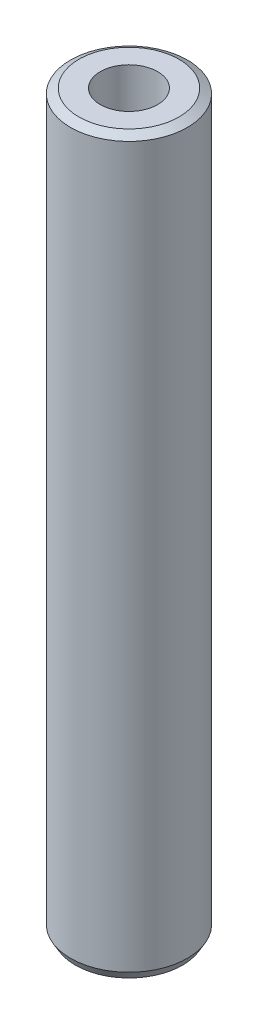
ISO-10303-21;
HEADER;
FILE_DESCRIPTION(('STEP AP214'),'2;1');
FILE_NAME('part.step','',(''),(''),'','','');
FILE_SCHEMA(('AUTOMOTIVE_DESIGN { 1 0 10303 214 1 1 1 1 }'));
ENDSEC;
DATA;
#1=APPLICATION_CONTEXT('core data for automotive mechanical design processes');
#2=APPLICATION_PROTOCOL_DEFINITION('international standard','automotive_design',2000,#1);
#3=PRODUCT_CONTEXT('',#1,'mechanical');
#4=PRODUCT('Part','Part','',(#3));
#5=PRODUCT_RELATED_PRODUCT_CATEGORY('part','',(#4));
#6=PRODUCT_DEFINITION_FORMATION('','',#4);
#7=PRODUCT_DEFINITION_CONTEXT('part definition',#1,'design');
#8=PRODUCT_DEFINITION('design','',#6,#7);
#9=PRODUCT_DEFINITION_SHAPE('','',#8);
#10=(LENGTH_UNIT() NAMED_UNIT(*) SI_UNIT(.MILLI.,.METRE.));
#11=(NAMED_UNIT(*) PLANE_ANGLE_UNIT() SI_UNIT($,.RADIAN.));
#12=(NAMED_UNIT(*) SI_UNIT($,.STERADIAN.) SOLID_ANGLE_UNIT());
#13=UNCERTAINTY_MEASURE_WITH_UNIT(LENGTH_MEASURE(1.E-05),#10,'distance_accuracy_value','');
#14=(GEOMETRIC_REPRESENTATION_CONTEXT(3) GLOBAL_UNCERTAINTY_ASSIGNED_CONTEXT((#13)) GLOBAL_UNIT_ASSIGNED_CONTEXT((#10,
#11,#12)) REPRESENTATION_CONTEXT('',''));
#15=CARTESIAN_POINT('',(0.,0.,0.));
#16=DIRECTION('',(0.,0.,1.));
#17=DIRECTION('',(1.,0.,0.));
#18=AXIS2_PLACEMENT_3D('',#15,#16,#17);
#19=CARTESIAN_POINT('',(0.,344.806056063156,0.));
#20=DIRECTION('',(0.,-1.,0.));
#21=DIRECTION('',(0.,0.,-1.));
#22=AXIS2_PLACEMENT_3D('',#19,#20,#21);
#23=CYLINDRICAL_SURFACE('',#22,27.5);
#24=CARTESIAN_POINT('',(0.,342.522350640957,0.));
#25=DIRECTION('',(0.,1.,0.));
#26=DIRECTION('',(0.,0.,1.));
#27=AXIS2_PLACEMENT_3D('',#24,#25,#26);
#28=CIRCLE('',#27,27.5);
#29=CARTESIAN_POINT('',(0.,342.522350640957,27.5));
#30=VERTEX_POINT('',#29);
#31=EDGE_CURVE('E50',#30,#30,#28,.F.);
#32=ORIENTED_EDGE('',*,*,#31,.T.);
#33=EDGE_LOOP('',(#32));
#34=FACE_BOUND('',#33,.T.);
#35=CARTESIAN_POINT('',(0.,3.95549382076954,0.));
#36=DIRECTION('',(0.,1.,0.));
#37=DIRECTION('',(0.,0.,1.));
#38=AXIS2_PLACEMENT_3D('',#35,#36,#37);
#39=CIRCLE('',#38,27.5);
#40=CARTESIAN_POINT('',(0.,3.95549382076954,27.5));
#41=VERTEX_POINT('',#40);
#42=EDGE_CURVE('E51',#41,#41,#39,.T.);
#43=ORIENTED_EDGE('',*,*,#42,.T.);
#44=EDGE_LOOP('',(#43));
#45=FACE_BOUND('',#44,.T.);
#46=ADVANCED_FACE('F39',(#34,#45),#23,.T.);
#47=CARTESIAN_POINT('',(0.,344.806056063156,0.));
#48=DIRECTION('',(0.,1.,0.));
#49=DIRECTION('',(0.,0.,1.));
#50=AXIS2_PLACEMENT_3D('',#47,#48,#49);
#51=PLANE('',#50);
#52=CARTESIAN_POINT('',(0.,344.806056063156,0.));
#53=DIRECTION('',(0.,1.,0.));
#54=DIRECTION('',(0.,0.,1.));
#55=AXIS2_PLACEMENT_3D('',#52,#53,#54);
#56=CIRCLE('',#55,23.5445061792306);
#57=CARTESIAN_POINT('',(0.,344.806056063156,23.5445061792306));
#58=VERTEX_POINT('',#57);
#59=EDGE_CURVE('E54',#58,#58,#56,.T.);
#60=ORIENTED_EDGE('',*,*,#59,.T.);
#61=EDGE_LOOP('',(#60));
#62=FACE_BOUND('',#61,.T.);
#63=CARTESIAN_POINT('',(0.,344.806056063156,0.));
#64=DIRECTION('',(0.,1.,0.));
#65=DIRECTION('',(0.,0.,1.));
#66=AXIS2_PLACEMENT_3D('',#63,#64,#65);
#67=CIRCLE('',#66,13.4741246889057);
#68=CARTESIAN_POINT('',(0.,344.806056063156,13.4741246889057));
#69=VERTEX_POINT('',#68);
#70=EDGE_CURVE('E58',#69,#69,#67,.T.);
#71=ORIENTED_EDGE('',*,*,#70,.F.);
#72=EDGE_LOOP('',(#71));
#73=FACE_BOUND('',#72,.T.);
#74=ADVANCED_FACE('F69',(#62,#73),#51,.T.);
#75=CARTESIAN_POINT('',(0.,0.,0.));
#76=DIRECTION('',(0.,1.,0.));
#77=DIRECTION('',(0.,0.,1.));
#78=AXIS2_PLACEMENT_3D('',#75,#76,#77);
#79=PLANE('',#78);
#80=CARTESIAN_POINT('',(0.,0.,0.));
#81=DIRECTION('',(0.,1.,0.));
#82=DIRECTION('',(0.,0.,1.));
#83=AXIS2_PLACEMENT_3D('',#80,#81,#82);
#84=CIRCLE('',#83,25.2162945778008);
#85=CARTESIAN_POINT('',(0.,0.,25.2162945778008));
#86=VERTEX_POINT('',#85);
#87=EDGE_CURVE('E10',#86,#86,#84,.F.);
#88=ORIENTED_EDGE('',*,*,#87,.T.);
#89=EDGE_LOOP('',(#88));
#90=FACE_BOUND('',#89,.T.);
#91=CARTESIAN_POINT('',(0.,0.,0.));
#92=DIRECTION('',(0.,1.,0.));
#93=DIRECTION('',(0.,0.,1.));
#94=AXIS2_PLACEMENT_3D('',#91,#92,#93);
#95=CIRCLE('',#94,13.4741246889057);
#96=CARTESIAN_POINT('',(0.,0.,13.4741246889057));
#97=VERTEX_POINT('',#96);
#98=EDGE_CURVE('E63',#97,#97,#95,.T.);
#99=ORIENTED_EDGE('',*,*,#98,.T.);
#100=EDGE_LOOP('',(#99));
#101=FACE_BOUND('',#100,.T.);
#102=ADVANCED_FACE('F75',(#90,#101),#79,.F.);
#103=CARTESIAN_POINT('',(0.,344.806056063156,0.));
#104=DIRECTION('',(0.,-1.,0.));
#105=DIRECTION('',(0.,0.,-1.));
#106=AXIS2_PLACEMENT_3D('',#103,#104,#105);
#107=CYLINDRICAL_SURFACE('',#106,13.4741246889057);
#108=ORIENTED_EDGE('',*,*,#70,.T.);
#109=EDGE_LOOP('',(#108));
#110=FACE_BOUND('',#109,.T.);
#111=ORIENTED_EDGE('',*,*,#98,.F.);
#112=EDGE_LOOP('',(#111));
#113=FACE_BOUND('',#112,.T.);
#114=ADVANCED_FACE('F70',(#110,#113),#107,.F.);
#115=CARTESIAN_POINT('',(0.,344.806056063156,0.));
#116=DIRECTION('',(0.,-1.,0.));
#117=DIRECTION('',(0.,0.,-1.));
#118=AXIS2_PLACEMENT_3D('',#115,#116,#117);
#119=CONICAL_SURFACE('',#118,23.5445061792306,1.04719755119661);
#120=ORIENTED_EDGE('',*,*,#31,.F.);
#121=EDGE_LOOP('',(#120));
#122=FACE_BOUND('',#121,.T.);
#123=ORIENTED_EDGE('',*,*,#59,.F.);
#124=EDGE_LOOP('',(#123));
#125=FACE_BOUND('',#124,.T.);
#126=ADVANCED_FACE('F81',(#122,#125),#119,.T.);
#127=CARTESIAN_POINT('',(0.,3.95549382076954,0.));
#128=DIRECTION('',(0.,1.,0.));
#129=DIRECTION('',(0.,0.,1.));
#130=AXIS2_PLACEMENT_3D('',#127,#128,#129);
#131=CONICAL_SURFACE('',#130,27.5,0.523598775598299);
#132=ORIENTED_EDGE('',*,*,#87,.F.);
#133=EDGE_LOOP('',(#132));
#134=FACE_BOUND('',#133,.T.);
#135=ORIENTED_EDGE('',*,*,#42,.F.);
#136=EDGE_LOOP('',(#135));
#137=FACE_BOUND('',#136,.T.);
#138=ADVANCED_FACE('F45',(#134,#137),#131,.T.);
#139=CLOSED_SHELL('',(#46,#74,#102,#114,#126,#138));
#140=MANIFOLD_SOLID_BREP('B2',#139);
#141=ADVANCED_BREP_SHAPE_REPRESENTATION('',(#18,#140),#14);
#142=SHAPE_DEFINITION_REPRESENTATION(#9,#141);
ENDSEC;
END-ISO-10303-21;
